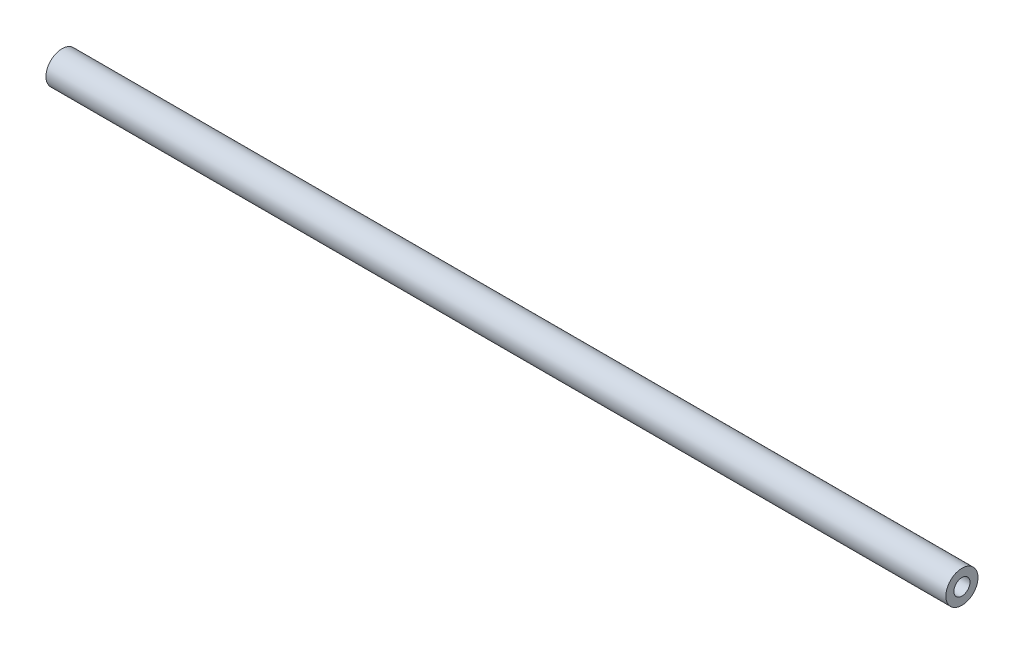
ISO-10303-21;
HEADER;
FILE_DESCRIPTION(('STEP AP214'),'2;1');
FILE_NAME('part.step','',(''),(''),'','','');
FILE_SCHEMA(('AUTOMOTIVE_DESIGN { 1 0 10303 214 1 1 1 1 }'));
ENDSEC;
DATA;
#1=APPLICATION_CONTEXT('core data for automotive mechanical design processes');
#2=APPLICATION_PROTOCOL_DEFINITION('international standard','automotive_design',2000,#1);
#3=PRODUCT_CONTEXT('',#1,'mechanical');
#4=PRODUCT('Part','Part','',(#3));
#5=PRODUCT_RELATED_PRODUCT_CATEGORY('part','',(#4));
#6=PRODUCT_DEFINITION_FORMATION('','',#4);
#7=PRODUCT_DEFINITION_CONTEXT('part definition',#1,'design');
#8=PRODUCT_DEFINITION('design','',#6,#7);
#9=PRODUCT_DEFINITION_SHAPE('','',#8);
#10=(LENGTH_UNIT() NAMED_UNIT(*) SI_UNIT(.MILLI.,.METRE.));
#11=(NAMED_UNIT(*) PLANE_ANGLE_UNIT() SI_UNIT($,.RADIAN.));
#12=(NAMED_UNIT(*) SI_UNIT($,.STERADIAN.) SOLID_ANGLE_UNIT());
#13=UNCERTAINTY_MEASURE_WITH_UNIT(LENGTH_MEASURE(1.E-05),#10,'distance_accuracy_value','');
#14=(GEOMETRIC_REPRESENTATION_CONTEXT(3) GLOBAL_UNCERTAINTY_ASSIGNED_CONTEXT((#13)) GLOBAL_UNIT_ASSIGNED_CONTEXT((#10,
#11,#12)) REPRESENTATION_CONTEXT('',''));
#15=CARTESIAN_POINT('',(0.,0.,0.));
#16=DIRECTION('',(0.,0.,1.));
#17=DIRECTION('',(1.,0.,0.));
#18=AXIS2_PLACEMENT_3D('',#15,#16,#17);
#19=CARTESIAN_POINT('',(355.6,0.,0.));
#20=DIRECTION('',(1.,0.,0.));
#21=DIRECTION('',(0.,0.,-1.));
#22=AXIS2_PLACEMENT_3D('',#19,#20,#21);
#23=PLANE('',#22);
#24=CARTESIAN_POINT('',(355.6,0.,0.));
#25=DIRECTION('',(1.,0.,0.));
#26=DIRECTION('',(0.,0.,-1.));
#27=AXIS2_PLACEMENT_3D('',#24,#25,#26);
#28=CIRCLE('',#27,6.35);
#29=CARTESIAN_POINT('',(355.6,0.,-6.35));
#30=VERTEX_POINT('',#29);
#31=EDGE_CURVE('E10',#30,#30,#28,.T.);
#32=ORIENTED_EDGE('',*,*,#31,.T.);
#33=EDGE_LOOP('',(#32));
#34=FACE_BOUND('',#33,.T.);
#35=CARTESIAN_POINT('',(355.6,0.,0.));
#36=DIRECTION('',(1.,0.,0.));
#37=DIRECTION('',(0.,0.,-1.));
#38=AXIS2_PLACEMENT_3D('',#35,#36,#37);
#39=CIRCLE('',#38,3.175);
#40=CARTESIAN_POINT('',(355.6,0.,-3.175));
#41=VERTEX_POINT('',#40);
#42=EDGE_CURVE('E48',#41,#41,#39,.T.);
#43=ORIENTED_EDGE('',*,*,#42,.F.);
#44=EDGE_LOOP('',(#43));
#45=FACE_BOUND('',#44,.T.);
#46=ADVANCED_FACE('F34',(#34,#45),#23,.T.);
#47=CARTESIAN_POINT('',(0.,0.,0.));
#48=DIRECTION('',(1.,0.,0.));
#49=DIRECTION('',(0.,0.,-1.));
#50=AXIS2_PLACEMENT_3D('',#47,#48,#49);
#51=PLANE('',#50);
#52=CARTESIAN_POINT('',(0.,0.,0.));
#53=DIRECTION('',(1.,0.,0.));
#54=DIRECTION('',(0.,0.,-1.));
#55=AXIS2_PLACEMENT_3D('',#52,#53,#54);
#56=CIRCLE('',#55,6.35);
#57=CARTESIAN_POINT('',(0.,0.,-6.35));
#58=VERTEX_POINT('',#57);
#59=EDGE_CURVE('E38',#58,#58,#56,.T.);
#60=ORIENTED_EDGE('',*,*,#59,.F.);
#61=EDGE_LOOP('',(#60));
#62=FACE_BOUND('',#61,.T.);
#63=CARTESIAN_POINT('',(0.,0.,0.));
#64=DIRECTION('',(1.,0.,0.));
#65=DIRECTION('',(0.,0.,-1.));
#66=AXIS2_PLACEMENT_3D('',#63,#64,#65);
#67=CIRCLE('',#66,3.175);
#68=CARTESIAN_POINT('',(0.,0.,-3.175));
#69=VERTEX_POINT('',#68);
#70=EDGE_CURVE('E50',#69,#69,#67,.T.);
#71=ORIENTED_EDGE('',*,*,#70,.T.);
#72=EDGE_LOOP('',(#71));
#73=FACE_BOUND('',#72,.T.);
#74=ADVANCED_FACE('F61',(#62,#73),#51,.F.);
#75=CARTESIAN_POINT('',(355.6,0.,0.));
#76=DIRECTION('',(-1.,0.,0.));
#77=DIRECTION('',(0.,0.,1.));
#78=AXIS2_PLACEMENT_3D('',#75,#76,#77);
#79=CYLINDRICAL_SURFACE('',#78,6.35);
#80=ORIENTED_EDGE('',*,*,#31,.F.);
#81=EDGE_LOOP('',(#80));
#82=FACE_BOUND('',#81,.T.);
#83=ORIENTED_EDGE('',*,*,#59,.T.);
#84=EDGE_LOOP('',(#83));
#85=FACE_BOUND('',#84,.T.);
#86=ADVANCED_FACE('F36',(#82,#85),#79,.T.);
#87=CARTESIAN_POINT('',(355.6,0.,0.));
#88=DIRECTION('',(-1.,0.,0.));
#89=DIRECTION('',(0.,0.,1.));
#90=AXIS2_PLACEMENT_3D('',#87,#88,#89);
#91=CYLINDRICAL_SURFACE('',#90,3.175);
#92=ORIENTED_EDGE('',*,*,#42,.T.);
#93=EDGE_LOOP('',(#92));
#94=FACE_BOUND('',#93,.T.);
#95=ORIENTED_EDGE('',*,*,#70,.F.);
#96=EDGE_LOOP('',(#95));
#97=FACE_BOUND('',#96,.T.);
#98=ADVANCED_FACE('F57',(#94,#97),#91,.F.);
#99=CLOSED_SHELL('',(#46,#74,#86,#98));
#100=MANIFOLD_SOLID_BREP('B2',#99);
#101=ADVANCED_BREP_SHAPE_REPRESENTATION('',(#18,#100),#14);
#102=SHAPE_DEFINITION_REPRESENTATION(#9,#101);
ENDSEC;
END-ISO-10303-21;
